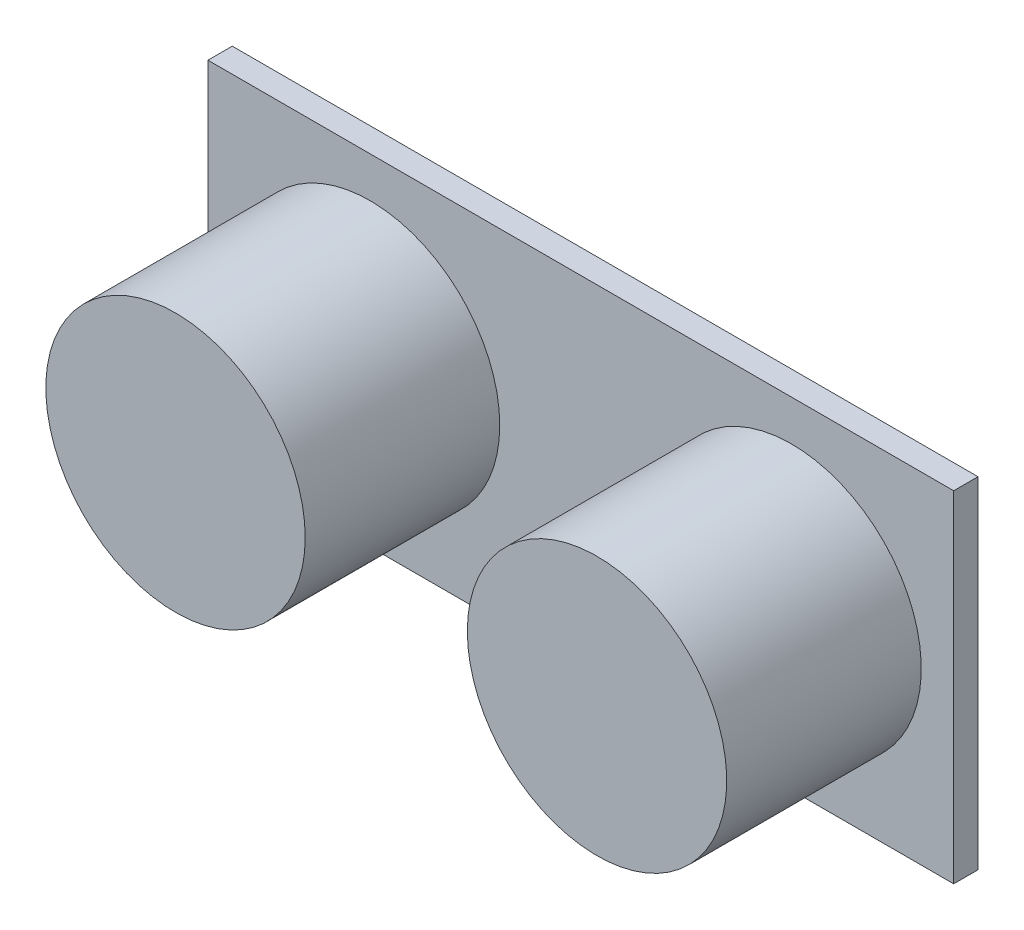
ISO-10303-21;
HEADER;
FILE_DESCRIPTION(('STEP AP214'),'2;1');
FILE_NAME('part.step','',(''),(''),'','','');
FILE_SCHEMA(('AUTOMOTIVE_DESIGN { 1 0 10303 214 1 1 1 1 }'));
ENDSEC;
DATA;
#1=APPLICATION_CONTEXT('core data for automotive mechanical design processes');
#2=APPLICATION_PROTOCOL_DEFINITION('international standard','automotive_design',2000,#1);
#3=PRODUCT_CONTEXT('',#1,'mechanical');
#4=PRODUCT('Part','Part','',(#3));
#5=PRODUCT_RELATED_PRODUCT_CATEGORY('part','',(#4));
#6=PRODUCT_DEFINITION_FORMATION('','',#4);
#7=PRODUCT_DEFINITION_CONTEXT('part definition',#1,'design');
#8=PRODUCT_DEFINITION('design','',#6,#7);
#9=PRODUCT_DEFINITION_SHAPE('','',#8);
#10=(LENGTH_UNIT() NAMED_UNIT(*) SI_UNIT(.MILLI.,.METRE.));
#11=(NAMED_UNIT(*) PLANE_ANGLE_UNIT() SI_UNIT($,.RADIAN.));
#12=(NAMED_UNIT(*) SI_UNIT($,.STERADIAN.) SOLID_ANGLE_UNIT());
#13=UNCERTAINTY_MEASURE_WITH_UNIT(LENGTH_MEASURE(1.E-05),#10,'distance_accuracy_value','');
#14=(GEOMETRIC_REPRESENTATION_CONTEXT(3) GLOBAL_UNCERTAINTY_ASSIGNED_CONTEXT((#13)) GLOBAL_UNIT_ASSIGNED_CONTEXT((#10,
#11,#12)) REPRESENTATION_CONTEXT('',''));
#15=CARTESIAN_POINT('',(0.,0.,0.));
#16=DIRECTION('',(0.,0.,1.));
#17=DIRECTION('',(1.,0.,0.));
#18=AXIS2_PLACEMENT_3D('',#15,#16,#17);
#19=CARTESIAN_POINT('',(28.,-19.475570490275,-3.5));
#20=DIRECTION('',(1.,0.,0.));
#21=DIRECTION('',(0.,0.,-1.));
#22=AXIS2_PLACEMENT_3D('',#19,#20,#21);
#23=PLANE('',#22);
#24=DIRECTION('',(0.,0.,1.));
#25=VECTOR('',#24,1.);
#26=CARTESIAN_POINT('',(28.,-19.475570490275,-3.5));
#27=LINE('',#26,#25);
#28=CARTESIAN_POINT('',(28.,-19.475570490275,-3.5));
#29=VERTEX_POINT('',#28);
#30=CARTESIAN_POINT('',(28.,-19.475570490275,2.5));
#31=VERTEX_POINT('',#30);
#32=EDGE_CURVE('E47',#29,#31,#27,.T.);
#33=ORIENTED_EDGE('',*,*,#32,.T.);
#34=DIRECTION('',(0.,1.,0.));
#35=VECTOR('',#34,1.);
#36=CARTESIAN_POINT('',(28.,-19.475570490275,2.5));
#37=LINE('',#36,#35);
#38=CARTESIAN_POINT('',(28.,-22.524429509725,2.5));
#39=VERTEX_POINT('',#38);
#40=EDGE_CURVE('E84',#39,#31,#37,.T.);
#41=ORIENTED_EDGE('',*,*,#40,.F.);
#42=DIRECTION('',(0.,0.,1.));
#43=VECTOR('',#42,1.);
#44=CARTESIAN_POINT('',(28.,-22.524429509725,-3.5));
#45=LINE('',#44,#43);
#46=CARTESIAN_POINT('',(28.,-22.524429509725,-3.5));
#47=VERTEX_POINT('',#46);
#48=EDGE_CURVE('E12',#47,#39,#45,.T.);
#49=ORIENTED_EDGE('',*,*,#48,.F.);
#50=DIRECTION('',(0.,1.,0.));
#51=VECTOR('',#50,1.);
#52=CARTESIAN_POINT('',(28.,-19.475570490275,-3.5));
#53=LINE('',#52,#51);
#54=EDGE_CURVE('E85',#47,#29,#53,.T.);
#55=ORIENTED_EDGE('',*,*,#54,.T.);
#56=EDGE_LOOP('',(#33,#41,#49,#55));
#57=FACE_BOUND('',#56,.T.);
#58=ADVANCED_FACE('F44',(#57),#23,.T.);
#59=CARTESIAN_POINT('',(18.,-22.524429509725,-3.5));
#60=DIRECTION('',(0.,-1.,0.));
#61=DIRECTION('',(0.,0.,-1.));
#62=AXIS2_PLACEMENT_3D('',#59,#60,#61);
#63=PLANE('',#62);
#64=ORIENTED_EDGE('',*,*,#48,.T.);
#65=DIRECTION('',(1.,0.,0.));
#66=VECTOR('',#65,1.);
#67=CARTESIAN_POINT('',(18.,-22.524429509725,2.5));
#68=LINE('',#67,#66);
#69=CARTESIAN_POINT('',(18.,-22.524429509725,2.5));
#70=VERTEX_POINT('',#69);
#71=EDGE_CURVE('E101',#70,#39,#68,.T.);
#72=ORIENTED_EDGE('',*,*,#71,.F.);
#73=DIRECTION('',(0.,0.,1.));
#74=VECTOR('',#73,1.);
#75=CARTESIAN_POINT('',(18.,-22.524429509725,-3.5));
#76=LINE('',#75,#74);
#77=CARTESIAN_POINT('',(18.,-22.524429509725,-3.5));
#78=VERTEX_POINT('',#77);
#79=EDGE_CURVE('E52',#78,#70,#76,.T.);
#80=ORIENTED_EDGE('',*,*,#79,.F.);
#81=DIRECTION('',(1.,0.,0.));
#82=VECTOR('',#81,1.);
#83=CARTESIAN_POINT('',(18.,-22.524429509725,-3.5));
#84=LINE('',#83,#82);
#85=EDGE_CURVE('E90',#78,#47,#84,.T.);
#86=ORIENTED_EDGE('',*,*,#85,.T.);
#87=EDGE_LOOP('',(#64,#72,#80,#86));
#88=FACE_BOUND('',#87,.T.);
#89=ADVANCED_FACE('F116',(#88),#63,.T.);
#90=CARTESIAN_POINT('',(18.,-19.475570490275,-3.5));
#91=DIRECTION('',(-1.,0.,0.));
#92=DIRECTION('',(0.,0.,1.));
#93=AXIS2_PLACEMENT_3D('',#90,#91,#92);
#94=PLANE('',#93);
#95=ORIENTED_EDGE('',*,*,#79,.T.);
#96=DIRECTION('',(0.,-1.,0.));
#97=VECTOR('',#96,1.);
#98=CARTESIAN_POINT('',(18.,-19.475570490275,2.5));
#99=LINE('',#98,#97);
#100=CARTESIAN_POINT('',(18.,-19.475570490275,2.5));
#101=VERTEX_POINT('',#100);
#102=EDGE_CURVE('E97',#101,#70,#99,.T.);
#103=ORIENTED_EDGE('',*,*,#102,.F.);
#104=DIRECTION('',(0.,0.,1.));
#105=VECTOR('',#104,1.);
#106=CARTESIAN_POINT('',(18.,-19.475570490275,-3.5));
#107=LINE('',#106,#105);
#108=CARTESIAN_POINT('',(18.,-19.475570490275,-3.5));
#109=VERTEX_POINT('',#108);
#110=EDGE_CURVE('E89',#109,#101,#107,.T.);
#111=ORIENTED_EDGE('',*,*,#110,.F.);
#112=DIRECTION('',(0.,-1.,0.));
#113=VECTOR('',#112,1.);
#114=CARTESIAN_POINT('',(18.,-19.475570490275,-3.5));
#115=LINE('',#114,#113);
#116=EDGE_CURVE('E109',#109,#78,#115,.T.);
#117=ORIENTED_EDGE('',*,*,#116,.T.);
#118=EDGE_LOOP('',(#95,#103,#111,#117));
#119=FACE_BOUND('',#118,.T.);
#120=ADVANCED_FACE('F113',(#119),#94,.T.);
#121=CARTESIAN_POINT('',(18.,-19.475570490275,-3.5));
#122=DIRECTION('',(0.,1.,0.));
#123=DIRECTION('',(0.,0.,1.));
#124=AXIS2_PLACEMENT_3D('',#121,#122,#123);
#125=PLANE('',#124);
#126=ORIENTED_EDGE('',*,*,#110,.T.);
#127=DIRECTION('',(-1.,0.,0.));
#128=VECTOR('',#127,1.);
#129=CARTESIAN_POINT('',(18.,-19.475570490275,2.5));
#130=LINE('',#129,#128);
#131=EDGE_CURVE('E92',#31,#101,#130,.T.);
#132=ORIENTED_EDGE('',*,*,#131,.F.);
#133=ORIENTED_EDGE('',*,*,#32,.F.);
#134=DIRECTION('',(-1.,0.,0.));
#135=VECTOR('',#134,1.);
#136=CARTESIAN_POINT('',(18.,-19.475570490275,-3.5));
#137=LINE('',#136,#135);
#138=EDGE_CURVE('E107',#29,#109,#137,.T.);
#139=ORIENTED_EDGE('',*,*,#138,.T.);
#140=EDGE_LOOP('',(#126,#132,#133,#139));
#141=FACE_BOUND('',#140,.T.);
#142=ADVANCED_FACE('F93',(#141),#125,.T.);
#143=CARTESIAN_POINT('',(0.,0.,-3.5));
#144=DIRECTION('',(0.,0.,1.));
#145=DIRECTION('',(1.,0.,0.));
#146=AXIS2_PLACEMENT_3D('',#143,#144,#145);
#147=PLANE('',#146);
#148=ORIENTED_EDGE('',*,*,#54,.F.);
#149=ORIENTED_EDGE('',*,*,#85,.F.);
#150=ORIENTED_EDGE('',*,*,#116,.F.);
#151=ORIENTED_EDGE('',*,*,#138,.F.);
#152=EDGE_LOOP('',(#148,#149,#150,#151));
#153=FACE_BOUND('',#152,.T.);
#154=ADVANCED_FACE('F118',(#153),#147,.F.);
#155=CARTESIAN_POINT('',(0.,0.,2.5));
#156=DIRECTION('',(0.,0.,1.));
#157=DIRECTION('',(1.,0.,0.));
#158=AXIS2_PLACEMENT_3D('',#155,#156,#157);
#159=PLANE('',#158);
#160=ORIENTED_EDGE('',*,*,#40,.T.);
#161=ORIENTED_EDGE('',*,*,#131,.T.);
#162=ORIENTED_EDGE('',*,*,#102,.T.);
#163=ORIENTED_EDGE('',*,*,#71,.T.);
#164=EDGE_LOOP('',(#160,#161,#162,#163));
#165=FACE_BOUND('',#164,.T.);
#166=ADVANCED_FACE('F100',(#165),#159,.T.);
#167=CLOSED_SHELL('',(#58,#89,#120,#142,#154,#166));
#168=MANIFOLD_SOLID_BREP('B2',#167);
#169=CARTESIAN_POINT('',(0.,0.,1.5));
#170=DIRECTION('',(1.,0.,0.));
#171=DIRECTION('',(0.,1.,0.));
#172=AXIS2_PLACEMENT_3D('',#169,#170,#171);
#173=PLANE('',#172);
#174=DIRECTION('',(0.,-1.,0.));
#175=VECTOR('',#174,1.);
#176=CARTESIAN_POINT('',(0.,0.,0.));
#177=LINE('',#176,#175);
#178=CARTESIAN_POINT('',(0.,0.,0.));
#179=VERTEX_POINT('',#178);
#180=CARTESIAN_POINT('',(0.,-21.,0.));
#181=VERTEX_POINT('',#180);
#182=EDGE_CURVE('E230',#179,#181,#177,.T.);
#183=ORIENTED_EDGE('',*,*,#182,.T.);
#184=DIRECTION('',(0.,0.,-1.));
#185=VECTOR('',#184,1.);
#186=CARTESIAN_POINT('',(0.,-21.,1.5));
#187=LINE('',#186,#185);
#188=CARTESIAN_POINT('',(0.,-21.,1.5));
#189=VERTEX_POINT('',#188);
#190=EDGE_CURVE('E42',#189,#181,#187,.T.);
#191=ORIENTED_EDGE('',*,*,#190,.F.);
#192=DIRECTION('',(0.,-1.,0.));
#193=VECTOR('',#192,1.);
#194=CARTESIAN_POINT('',(0.,0.,1.5));
#195=LINE('',#194,#193);
#196=CARTESIAN_POINT('',(0.,0.,1.5));
#197=VERTEX_POINT('',#196);
#198=EDGE_CURVE('E218',#197,#189,#195,.T.);
#199=ORIENTED_EDGE('',*,*,#198,.F.);
#200=DIRECTION('',(0.,0.,-1.));
#201=VECTOR('',#200,1.);
#202=CARTESIAN_POINT('',(0.,0.,1.5));
#203=LINE('',#202,#201);
#204=EDGE_CURVE('E226',#197,#179,#203,.T.);
#205=ORIENTED_EDGE('',*,*,#204,.T.);
#206=EDGE_LOOP('',(#183,#191,#199,#205));
#207=FACE_BOUND('',#206,.T.);
#208=ADVANCED_FACE('F167',(#207),#173,.F.);
#209=CARTESIAN_POINT('',(0.,-21.,1.5));
#210=DIRECTION('',(0.,1.,0.));
#211=DIRECTION('',(0.,0.,1.));
#212=AXIS2_PLACEMENT_3D('',#209,#210,#211);
#213=PLANE('',#212);
#214=DIRECTION('',(1.,0.,0.));
#215=VECTOR('',#214,1.);
#216=CARTESIAN_POINT('',(0.,-21.,0.));
#217=LINE('',#216,#215);
#218=CARTESIAN_POINT('',(46.,-21.,0.));
#219=VERTEX_POINT('',#218);
#220=EDGE_CURVE('E222',#181,#219,#217,.T.);
#221=ORIENTED_EDGE('',*,*,#220,.T.);
#222=DIRECTION('',(0.,0.,-1.));
#223=VECTOR('',#222,1.);
#224=CARTESIAN_POINT('',(46.,-21.,1.5));
#225=LINE('',#224,#223);
#226=CARTESIAN_POINT('',(46.,-21.,1.5));
#227=VERTEX_POINT('',#226);
#228=EDGE_CURVE('E175',#227,#219,#225,.T.);
#229=ORIENTED_EDGE('',*,*,#228,.F.);
#230=DIRECTION('',(1.,0.,0.));
#231=VECTOR('',#230,1.);
#232=CARTESIAN_POINT('',(0.,-21.,1.5));
#233=LINE('',#232,#231);
#234=EDGE_CURVE('E213',#189,#227,#233,.T.);
#235=ORIENTED_EDGE('',*,*,#234,.F.);
#236=ORIENTED_EDGE('',*,*,#190,.T.);
#237=EDGE_LOOP('',(#221,#229,#235,#236));
#238=FACE_BOUND('',#237,.T.);
#239=ADVANCED_FACE('F221',(#238),#213,.F.);
#240=CARTESIAN_POINT('',(46.,0.,1.5));
#241=DIRECTION('',(-1.,0.,0.));
#242=DIRECTION('',(0.,0.,1.));
#243=AXIS2_PLACEMENT_3D('',#240,#241,#242);
#244=PLANE('',#243);
#245=DIRECTION('',(0.,1.,0.));
#246=VECTOR('',#245,1.);
#247=CARTESIAN_POINT('',(46.,0.,0.));
#248=LINE('',#247,#246);
#249=CARTESIAN_POINT('',(46.,0.,0.));
#250=VERTEX_POINT('',#249);
#251=EDGE_CURVE('E200',#219,#250,#248,.T.);
#252=ORIENTED_EDGE('',*,*,#251,.T.);
#253=DIRECTION('',(0.,0.,-1.));
#254=VECTOR('',#253,1.);
#255=CARTESIAN_POINT('',(46.,0.,1.5));
#256=LINE('',#255,#254);
#257=CARTESIAN_POINT('',(46.,0.,1.5));
#258=VERTEX_POINT('',#257);
#259=EDGE_CURVE('E223',#258,#250,#256,.T.);
#260=ORIENTED_EDGE('',*,*,#259,.F.);
#261=DIRECTION('',(0.,1.,0.));
#262=VECTOR('',#261,1.);
#263=CARTESIAN_POINT('',(46.,0.,1.5));
#264=LINE('',#263,#262);
#265=EDGE_CURVE('E216',#227,#258,#264,.T.);
#266=ORIENTED_EDGE('',*,*,#265,.F.);
#267=ORIENTED_EDGE('',*,*,#228,.T.);
#268=EDGE_LOOP('',(#252,#260,#266,#267));
#269=FACE_BOUND('',#268,.T.);
#270=ADVANCED_FACE('F224',(#269),#244,.F.);
#271=CARTESIAN_POINT('',(0.,0.,1.5));
#272=DIRECTION('',(0.,-1.,0.));
#273=DIRECTION('',(0.,0.,-1.));
#274=AXIS2_PLACEMENT_3D('',#271,#272,#273);
#275=PLANE('',#274);
#276=DIRECTION('',(-1.,0.,0.));
#277=VECTOR('',#276,1.);
#278=CARTESIAN_POINT('',(0.,0.,0.));
#279=LINE('',#278,#277);
#280=EDGE_CURVE('E206',#250,#179,#279,.T.);
#281=ORIENTED_EDGE('',*,*,#280,.T.);
#282=ORIENTED_EDGE('',*,*,#204,.F.);
#283=DIRECTION('',(-1.,0.,0.));
#284=VECTOR('',#283,1.);
#285=CARTESIAN_POINT('',(0.,0.,1.5));
#286=LINE('',#285,#284);
#287=EDGE_CURVE('E183',#258,#197,#286,.T.);
#288=ORIENTED_EDGE('',*,*,#287,.F.);
#289=ORIENTED_EDGE('',*,*,#259,.T.);
#290=EDGE_LOOP('',(#281,#282,#288,#289));
#291=FACE_BOUND('',#290,.T.);
#292=ADVANCED_FACE('F238',(#291),#275,.F.);
#293=CARTESIAN_POINT('',(0.,0.,1.5));
#294=DIRECTION('',(0.,0.,1.));
#295=DIRECTION('',(1.,0.,0.));
#296=AXIS2_PLACEMENT_3D('',#293,#294,#295);
#297=PLANE('',#296);
#298=CARTESIAN_POINT('',(36.,-10.5,1.5));
#299=DIRECTION('',(0.,0.,1.));
#300=DIRECTION('',(-1.,0.,0.));
#301=AXIS2_PLACEMENT_3D('',#298,#299,#300);
#302=CIRCLE('',#301,8.00000000000001);
#303=CARTESIAN_POINT('',(28.,-10.5,1.5));
#304=VERTEX_POINT('',#303);
#305=EDGE_CURVE('E250',#304,#304,#302,.T.);
#306=ORIENTED_EDGE('',*,*,#305,.F.);
#307=EDGE_LOOP('',(#306));
#308=FACE_BOUND('',#307,.T.);
#309=CARTESIAN_POINT('',(10.,-10.5,1.5));
#310=DIRECTION('',(0.,0.,1.));
#311=DIRECTION('',(1.,0.,0.));
#312=AXIS2_PLACEMENT_3D('',#309,#310,#311);
#313=CIRCLE('',#312,8.);
#314=CARTESIAN_POINT('',(18.,-10.5,1.5));
#315=VERTEX_POINT('',#314);
#316=EDGE_CURVE('E244',#315,#315,#313,.T.);
#317=ORIENTED_EDGE('',*,*,#316,.F.);
#318=EDGE_LOOP('',(#317));
#319=FACE_BOUND('',#318,.T.);
#320=ORIENTED_EDGE('',*,*,#198,.T.);
#321=ORIENTED_EDGE('',*,*,#234,.T.);
#322=ORIENTED_EDGE('',*,*,#265,.T.);
#323=ORIENTED_EDGE('',*,*,#287,.T.);
#324=EDGE_LOOP('',(#320,#321,#322,#323));
#325=FACE_BOUND('',#324,.T.);
#326=ADVANCED_FACE('F214',(#308,#319,#325),#297,.T.);
#327=CARTESIAN_POINT('',(0.,0.,0.));
#328=DIRECTION('',(0.,0.,1.));
#329=DIRECTION('',(1.,0.,0.));
#330=AXIS2_PLACEMENT_3D('',#327,#328,#329);
#331=PLANE('',#330);
#332=ORIENTED_EDGE('',*,*,#182,.F.);
#333=ORIENTED_EDGE('',*,*,#280,.F.);
#334=ORIENTED_EDGE('',*,*,#251,.F.);
#335=ORIENTED_EDGE('',*,*,#220,.F.);
#336=EDGE_LOOP('',(#332,#333,#334,#335));
#337=FACE_BOUND('',#336,.T.);
#338=ADVANCED_FACE('F241',(#337),#331,.F.);
#339=CARTESIAN_POINT('',(10.,-10.5,13.5));
#340=DIRECTION('',(0.,0.,-1.));
#341=DIRECTION('',(-1.,0.,0.));
#342=AXIS2_PLACEMENT_3D('',#339,#340,#341);
#343=CYLINDRICAL_SURFACE('',#342,8.);
#344=CARTESIAN_POINT('',(10.,-10.5,13.5));
#345=DIRECTION('',(0.,0.,1.));
#346=DIRECTION('',(1.,0.,0.));
#347=AXIS2_PLACEMENT_3D('',#344,#345,#346);
#348=CIRCLE('',#347,8.);
#349=CARTESIAN_POINT('',(18.,-10.5,13.5));
#350=VERTEX_POINT('',#349);
#351=EDGE_CURVE('E233',#350,#350,#348,.T.);
#352=ORIENTED_EDGE('',*,*,#351,.F.);
#353=EDGE_LOOP('',(#352));
#354=FACE_BOUND('',#353,.T.);
#355=ORIENTED_EDGE('',*,*,#316,.T.);
#356=EDGE_LOOP('',(#355));
#357=FACE_BOUND('',#356,.T.);
#358=ADVANCED_FACE('F270',(#354,#357),#343,.T.);
#359=CARTESIAN_POINT('',(10.,-10.5,13.5));
#360=DIRECTION('',(0.,0.,1.));
#361=DIRECTION('',(1.,0.,0.));
#362=AXIS2_PLACEMENT_3D('',#359,#360,#361);
#363=PLANE('',#362);
#364=ORIENTED_EDGE('',*,*,#351,.T.);
#365=EDGE_LOOP('',(#364));
#366=FACE_BOUND('',#365,.T.);
#367=ADVANCED_FACE('F261',(#366),#363,.T.);
#368=CARTESIAN_POINT('',(36.,-10.5,13.5));
#369=DIRECTION('',(0.,0.,-1.));
#370=DIRECTION('',(-1.,0.,0.));
#371=AXIS2_PLACEMENT_3D('',#368,#369,#370);
#372=CYLINDRICAL_SURFACE('',#371,8.00000000000001);
#373=CARTESIAN_POINT('',(36.,-10.5,13.5));
#374=DIRECTION('',(0.,0.,1.));
#375=DIRECTION('',(-1.,0.,0.));
#376=AXIS2_PLACEMENT_3D('',#373,#374,#375);
#377=CIRCLE('',#376,8.00000000000001);
#378=CARTESIAN_POINT('',(28.,-10.5,13.5));
#379=VERTEX_POINT('',#378);
#380=EDGE_CURVE('E247',#379,#379,#377,.T.);
#381=ORIENTED_EDGE('',*,*,#380,.F.);
#382=EDGE_LOOP('',(#381));
#383=FACE_BOUND('',#382,.T.);
#384=ORIENTED_EDGE('',*,*,#305,.T.);
#385=EDGE_LOOP('',(#384));
#386=FACE_BOUND('',#385,.T.);
#387=ADVANCED_FACE('F258',(#383,#386),#372,.T.);
#388=CARTESIAN_POINT('',(36.,-10.5,13.5));
#389=DIRECTION('',(0.,0.,-1.));
#390=DIRECTION('',(-1.,0.,0.));
#391=AXIS2_PLACEMENT_3D('',#388,#389,#390);
#392=PLANE('',#391);
#393=ORIENTED_EDGE('',*,*,#380,.T.);
#394=EDGE_LOOP('',(#393));
#395=FACE_BOUND('',#394,.T.);
#396=ADVANCED_FACE('F256',(#395),#392,.F.);
#397=CLOSED_SHELL('',(#208,#239,#270,#292,#326,#338,#358,#367,#387,#396));
#398=MANIFOLD_SOLID_BREP('B6',#397);
#399=ADVANCED_BREP_SHAPE_REPRESENTATION('',(#18,#168,#398),#14);
#400=SHAPE_DEFINITION_REPRESENTATION(#9,#399);
ENDSEC;
END-ISO-10303-21;
